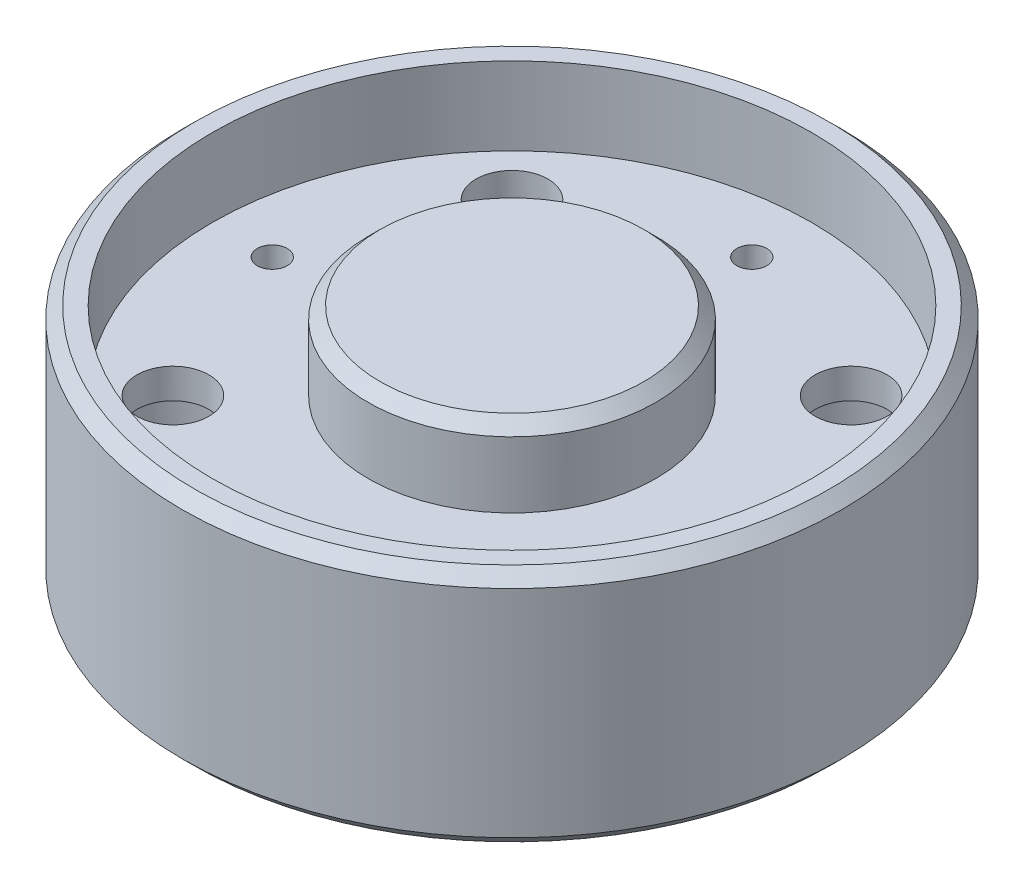
ISO-10303-21;
HEADER;
FILE_DESCRIPTION(('STEP AP214'),'2;1');
FILE_NAME('part.step','',(''),(''),'','','');
FILE_SCHEMA(('AUTOMOTIVE_DESIGN { 1 0 10303 214 1 1 1 1 }'));
ENDSEC;
DATA;
#1=APPLICATION_CONTEXT('core data for automotive mechanical design processes');
#2=APPLICATION_PROTOCOL_DEFINITION('international standard','automotive_design',2000,#1);
#3=PRODUCT_CONTEXT('',#1,'mechanical');
#4=PRODUCT('Part','Part','',(#3));
#5=PRODUCT_RELATED_PRODUCT_CATEGORY('part','',(#4));
#6=PRODUCT_DEFINITION_FORMATION('','',#4);
#7=PRODUCT_DEFINITION_CONTEXT('part definition',#1,'design');
#8=PRODUCT_DEFINITION('design','',#6,#7);
#9=PRODUCT_DEFINITION_SHAPE('','',#8);
#10=(LENGTH_UNIT() NAMED_UNIT(*) SI_UNIT(.MILLI.,.METRE.));
#11=(NAMED_UNIT(*) PLANE_ANGLE_UNIT() SI_UNIT($,.RADIAN.));
#12=(NAMED_UNIT(*) SI_UNIT($,.STERADIAN.) SOLID_ANGLE_UNIT());
#13=UNCERTAINTY_MEASURE_WITH_UNIT(LENGTH_MEASURE(1.E-05),#10,'distance_accuracy_value','');
#14=(GEOMETRIC_REPRESENTATION_CONTEXT(3) GLOBAL_UNCERTAINTY_ASSIGNED_CONTEXT((#13)) GLOBAL_UNIT_ASSIGNED_CONTEXT((#10,
#11,#12)) REPRESENTATION_CONTEXT('',''));
#15=CARTESIAN_POINT('',(0.,0.,0.));
#16=DIRECTION('',(0.,0.,1.));
#17=DIRECTION('',(1.,0.,0.));
#18=AXIS2_PLACEMENT_3D('',#15,#16,#17);
#19=CARTESIAN_POINT('',(14.142135623731,-1.2E-05,-14.142135623731));
#20=DIRECTION('',(0.,1.,0.));
#21=DIRECTION('',(0.,0.,1.));
#22=AXIS2_PLACEMENT_3D('',#19,#20,#21);
#23=CYLINDRICAL_SURFACE('',#22,3.);
#24=CARTESIAN_POINT('',(14.142135623731,13.5,-14.142135623731));
#25=DIRECTION('',(0.,1.,0.));
#26=DIRECTION('',(-1.,0.,0.));
#27=AXIS2_PLACEMENT_3D('',#24,#25,#26);
#28=CIRCLE('',#27,3.);
#29=CARTESIAN_POINT('',(11.142135623731,13.5,-14.142135623731));
#30=VERTEX_POINT('',#29);
#31=EDGE_CURVE('E591',#30,#30,#28,.T.);
#32=ORIENTED_EDGE('',*,*,#31,.T.);
#33=EDGE_LOOP('',(#32));
#34=FACE_BOUND('',#33,.T.);
#35=CARTESIAN_POINT('',(14.142135623731,11.,-14.142135623731));
#36=DIRECTION('',(0.,-1.,0.));
#37=DIRECTION('',(1.,0.,0.));
#38=AXIS2_PLACEMENT_3D('',#35,#36,#37);
#39=CIRCLE('',#38,3.);
#40=CARTESIAN_POINT('',(17.142135623731,11.0000000000001,-14.142135623731));
#41=VERTEX_POINT('',#40);
#42=EDGE_CURVE('E574',#41,#41,#39,.F.);
#43=ORIENTED_EDGE('',*,*,#42,.F.);
#44=EDGE_LOOP('',(#43));
#45=FACE_BOUND('',#44,.T.);
#46=ADVANCED_FACE('F40',(#34,#45),#23,.F.);
#47=CARTESIAN_POINT('',(-14.1421356237309,-1.2E-05,14.1421356237309));
#48=DIRECTION('',(0.,1.,0.));
#49=DIRECTION('',(0.,0.,1.));
#50=AXIS2_PLACEMENT_3D('',#47,#48,#49);
#51=CYLINDRICAL_SURFACE('',#50,3.);
#52=CARTESIAN_POINT('',(-14.1421356237309,13.4999999999999,14.1421356237309));
#53=DIRECTION('',(0.,1.,0.));
#54=DIRECTION('',(-1.,0.,0.));
#55=AXIS2_PLACEMENT_3D('',#52,#53,#54);
#56=CIRCLE('',#55,3.);
#57=CARTESIAN_POINT('',(-17.1421356237309,13.4999999999999,14.1421356237309));
#58=VERTEX_POINT('',#57);
#59=EDGE_CURVE('E166',#58,#58,#56,.T.);
#60=ORIENTED_EDGE('',*,*,#59,.T.);
#61=EDGE_LOOP('',(#60));
#62=FACE_BOUND('',#61,.T.);
#63=CARTESIAN_POINT('',(-14.1421356237309,11.,14.1421356237309));
#64=DIRECTION('',(0.,-1.,0.));
#65=DIRECTION('',(1.,0.,0.));
#66=AXIS2_PLACEMENT_3D('',#63,#64,#65);
#67=CIRCLE('',#66,3.);
#68=CARTESIAN_POINT('',(-11.1421356237309,11.,14.1421356237309));
#69=VERTEX_POINT('',#68);
#70=EDGE_CURVE('E181',#69,#69,#67,.F.);
#71=ORIENTED_EDGE('',*,*,#70,.F.);
#72=EDGE_LOOP('',(#71));
#73=FACE_BOUND('',#72,.T.);
#74=ADVANCED_FACE('F264',(#62,#73),#51,.F.);
#75=CARTESIAN_POINT('',(2.14969366173535E-12,-626.687351977546,0.));
#76=DIRECTION('',(0.,-1.,0.));
#77=DIRECTION('',(1.,0.,0.));
#78=AXIS2_PLACEMENT_3D('',#75,#76,#77);
#79=CYLINDRICAL_SURFACE('',#78,22.4);
#80=DIRECTION('',(0.,-1.,0.));
#81=VECTOR('',#80,1.);
#82=CARTESIAN_POINT('',(-19.0841693823817,5.49999999999993,-11.7283621612128));
#83=LINE('',#82,#81);
#84=CARTESIAN_POINT('',(-19.0841693823816,5.4999999999999,-11.7283621612128));
#85=VERTEX_POINT('',#84);
#86=CARTESIAN_POINT('',(-19.0841693823816,0.,-11.7283621612128));
#87=VERTEX_POINT('',#86);
#88=EDGE_CURVE('E167',#85,#87,#83,.T.);
#89=ORIENTED_EDGE('',*,*,#88,.F.);
#90=CARTESIAN_POINT('',(0.,5.49999999999984,0.));
#91=DIRECTION('',(0.,-1.,0.));
#92=DIRECTION('',(1.,0.,0.));
#93=AXIS2_PLACEMENT_3D('',#90,#91,#92);
#94=CIRCLE('',#93,22.4);
#95=CARTESIAN_POINT('',(-19.0841693823816,5.4999999999999,11.7283621612128));
#96=VERTEX_POINT('',#95);
#97=EDGE_CURVE('E146',#96,#85,#94,.T.);
#98=ORIENTED_EDGE('',*,*,#97,.F.);
#99=DIRECTION('',(0.,-1.,0.));
#100=VECTOR('',#99,1.);
#101=CARTESIAN_POINT('',(-19.0841693823817,5.49999999999993,11.7283621612128));
#102=LINE('',#101,#100);
#103=CARTESIAN_POINT('',(-19.0841693823816,0.,11.7283621612128));
#104=VERTEX_POINT('',#103);
#105=EDGE_CURVE('E117',#104,#96,#102,.F.);
#106=ORIENTED_EDGE('',*,*,#105,.F.);
#107=CARTESIAN_POINT('',(0.,-1.11022302462516E-13,0.));
#108=DIRECTION('',(0.,-1.,0.));
#109=DIRECTION('',(1.,0.,0.));
#110=AXIS2_PLACEMENT_3D('',#107,#108,#109);
#111=CIRCLE('',#110,22.4);
#112=EDGE_CURVE('E128',#104,#87,#111,.T.);
#113=ORIENTED_EDGE('',*,*,#112,.T.);
#114=EDGE_LOOP('',(#89,#98,#106,#113));
#115=FACE_BOUND('',#114,.T.);
#116=ADVANCED_FACE('F261',(#115),#79,.F.);
#117=DIRECTION('',(0.,-1.,0.));
#118=VECTOR('',#117,1.);
#119=CARTESIAN_POINT('',(11.7283621612128,5.50000000000004,19.0841693823816));
#120=LINE('',#119,#118);
#121=CARTESIAN_POINT('',(11.7283621612128,0.,19.0841693823816));
#122=VERTEX_POINT('',#121);
#123=CARTESIAN_POINT('',(11.7283621612128,5.50000000000001,19.0841693823816));
#124=VERTEX_POINT('',#123);
#125=EDGE_CURVE('E56',#122,#124,#120,.F.);
#126=ORIENTED_EDGE('',*,*,#125,.F.);
#127=CARTESIAN_POINT('',(-11.7283621612128,0.,19.0841693823816));
#128=VERTEX_POINT('',#127);
#129=EDGE_CURVE('E126',#122,#128,#111,.T.);
#130=ORIENTED_EDGE('',*,*,#129,.T.);
#131=DIRECTION('',(0.,-1.,0.));
#132=VECTOR('',#131,1.);
#133=CARTESIAN_POINT('',(-11.7283621612128,5.49999999999996,19.0841693823816));
#134=LINE('',#133,#132);
#135=CARTESIAN_POINT('',(-11.7283621612128,5.49999999999993,19.0841693823816));
#136=VERTEX_POINT('',#135);
#137=EDGE_CURVE('E105',#136,#128,#134,.T.);
#138=ORIENTED_EDGE('',*,*,#137,.F.);
#139=EDGE_CURVE('E142',#124,#136,#94,.T.);
#140=ORIENTED_EDGE('',*,*,#139,.F.);
#141=EDGE_LOOP('',(#126,#130,#138,#140));
#142=FACE_BOUND('',#141,.T.);
#143=ADVANCED_FACE('F132',(#142),#79,.F.);
#144=DIRECTION('',(0.,-1.,0.));
#145=VECTOR('',#144,1.);
#146=CARTESIAN_POINT('',(19.0841693823816,5.50000000000007,-11.7283621612128));
#147=LINE('',#146,#145);
#148=CARTESIAN_POINT('',(19.0841693823816,0.,-11.7283621612128));
#149=VERTEX_POINT('',#148);
#150=CARTESIAN_POINT('',(19.0841693823816,5.50000000000004,-11.7283621612128));
#151=VERTEX_POINT('',#150);
#152=EDGE_CURVE('E64',#149,#151,#147,.F.);
#153=ORIENTED_EDGE('',*,*,#152,.F.);
#154=CARTESIAN_POINT('',(19.0841693823816,0.,11.7283621612128));
#155=VERTEX_POINT('',#154);
#156=EDGE_CURVE('E135',#149,#155,#111,.T.);
#157=ORIENTED_EDGE('',*,*,#156,.T.);
#158=DIRECTION('',(0.,-1.,0.));
#159=VECTOR('',#158,1.);
#160=CARTESIAN_POINT('',(19.0841693823816,5.50000000000007,11.7283621612128));
#161=LINE('',#160,#159);
#162=CARTESIAN_POINT('',(19.0841693823816,5.50000000000004,11.7283621612128));
#163=VERTEX_POINT('',#162);
#164=EDGE_CURVE('E176',#163,#155,#161,.T.);
#165=ORIENTED_EDGE('',*,*,#164,.F.);
#166=EDGE_CURVE('E147',#151,#163,#94,.T.);
#167=ORIENTED_EDGE('',*,*,#166,.F.);
#168=EDGE_LOOP('',(#153,#157,#165,#167));
#169=FACE_BOUND('',#168,.T.);
#170=ADVANCED_FACE('F252',(#169),#79,.F.);
#171=CARTESIAN_POINT('',(27.4999999999999,0.,0.));
#172=DIRECTION('',(0.,-1.,0.));
#173=DIRECTION('',(1.,0.,0.));
#174=AXIS2_PLACEMENT_3D('',#171,#172,#173);
#175=PLANE('',#174);
#176=CARTESIAN_POINT('',(0.,0.,0.));
#177=DIRECTION('',(0.,-1.,0.));
#178=DIRECTION('',(1.,0.,0.));
#179=AXIS2_PLACEMENT_3D('',#176,#177,#178);
#180=CIRCLE('',#179,26.4999999999998);
#181=CARTESIAN_POINT('',(26.4999999999998,0.,0.));
#182=VERTEX_POINT('',#181);
#183=EDGE_CURVE('E11',#182,#182,#180,.T.);
#184=ORIENTED_EDGE('',*,*,#183,.T.);
#185=EDGE_LOOP('',(#184));
#186=FACE_BOUND('',#185,.T.);
#187=CARTESIAN_POINT('',(-14.1421356237309,0.,-14.1421356237309));
#188=DIRECTION('',(0.,-1.,0.));
#189=DIRECTION('',(-1.,0.,0.));
#190=AXIS2_PLACEMENT_3D('',#187,#188,#189);
#191=CIRCLE('',#190,5.5);
#192=CARTESIAN_POINT('',(-11.7283621612128,0.,-19.0841693823816));
#193=VERTEX_POINT('',#192);
#194=EDGE_CURVE('E182',#87,#193,#191,.T.);
#195=ORIENTED_EDGE('',*,*,#194,.F.);
#196=ORIENTED_EDGE('',*,*,#112,.F.);
#197=CARTESIAN_POINT('',(-14.1421356237309,0.,14.1421356237309));
#198=DIRECTION('',(0.,-1.,0.));
#199=DIRECTION('',(1.,0.,0.));
#200=AXIS2_PLACEMENT_3D('',#197,#198,#199);
#201=CIRCLE('',#200,5.5);
#202=EDGE_CURVE('E109',#128,#104,#201,.T.);
#203=ORIENTED_EDGE('',*,*,#202,.F.);
#204=ORIENTED_EDGE('',*,*,#129,.F.);
#205=CARTESIAN_POINT('',(14.1421356237309,0.,14.1421356237309));
#206=DIRECTION('',(0.,-1.,0.));
#207=DIRECTION('',(-1.,0.,0.));
#208=AXIS2_PLACEMENT_3D('',#205,#206,#207);
#209=CIRCLE('',#208,5.5);
#210=EDGE_CURVE('E193',#155,#122,#209,.T.);
#211=ORIENTED_EDGE('',*,*,#210,.F.);
#212=ORIENTED_EDGE('',*,*,#156,.F.);
#213=CARTESIAN_POINT('',(14.1421356237309,0.,-14.1421356237309));
#214=DIRECTION('',(0.,-1.,0.));
#215=DIRECTION('',(1.,0.,0.));
#216=AXIS2_PLACEMENT_3D('',#213,#214,#215);
#217=CIRCLE('',#216,5.5);
#218=CARTESIAN_POINT('',(11.7283621612128,0.,-19.0841693823816));
#219=VERTEX_POINT('',#218);
#220=EDGE_CURVE('E188',#219,#149,#217,.T.);
#221=ORIENTED_EDGE('',*,*,#220,.F.);
#222=EDGE_CURVE('E134',#193,#219,#111,.T.);
#223=ORIENTED_EDGE('',*,*,#222,.F.);
#224=EDGE_LOOP('',(#195,#196,#203,#204,#211,#212,#221,#223));
#225=FACE_BOUND('',#224,.T.);
#226=ADVANCED_FACE('F124',(#186,#225),#175,.T.);
#227=DIRECTION('',(0.,-1.,0.));
#228=VECTOR('',#227,1.);
#229=CARTESIAN_POINT('',(-11.7283621612128,5.49999999999996,-19.0841693823816));
#230=LINE('',#229,#228);
#231=CARTESIAN_POINT('',(-11.7283621612128,5.49999999999993,-19.0841693823816));
#232=VERTEX_POINT('',#231);
#233=EDGE_CURVE('E170',#193,#232,#230,.F.);
#234=ORIENTED_EDGE('',*,*,#233,.F.);
#235=ORIENTED_EDGE('',*,*,#222,.T.);
#236=DIRECTION('',(0.,-1.,0.));
#237=VECTOR('',#236,1.);
#238=CARTESIAN_POINT('',(11.7283621612128,5.50000000000004,-19.0841693823816));
#239=LINE('',#238,#237);
#240=CARTESIAN_POINT('',(11.7283621612128,5.50000000000001,-19.0841693823816));
#241=VERTEX_POINT('',#240);
#242=EDGE_CURVE('E173',#241,#219,#239,.T.);
#243=ORIENTED_EDGE('',*,*,#242,.F.);
#244=EDGE_CURVE('E150',#232,#241,#94,.T.);
#245=ORIENTED_EDGE('',*,*,#244,.F.);
#246=EDGE_LOOP('',(#234,#235,#243,#245));
#247=FACE_BOUND('',#246,.T.);
#248=ADVANCED_FACE('F227',(#247),#79,.F.);
#249=CARTESIAN_POINT('',(22.4,5.50000000000004,0.));
#250=DIRECTION('',(0.,-1.,0.));
#251=DIRECTION('',(1.,0.,0.));
#252=AXIS2_PLACEMENT_3D('',#249,#250,#251);
#253=PLANE('',#252);
#254=CARTESIAN_POINT('',(-20.,5.49999999999989,0.));
#255=DIRECTION('',(0.,-1.,0.));
#256=DIRECTION('',(1.,0.,0.));
#257=AXIS2_PLACEMENT_3D('',#254,#255,#256);
#258=CIRCLE('',#257,1.25);
#259=CARTESIAN_POINT('',(-18.75,5.49999999999989,0.));
#260=VERTEX_POINT('',#259);
#261=EDGE_CURVE('E185',#260,#260,#258,.T.);
#262=ORIENTED_EDGE('',*,*,#261,.F.);
#263=EDGE_LOOP('',(#262));
#264=FACE_BOUND('',#263,.T.);
#265=CARTESIAN_POINT('',(0.,5.49999999999996,-20.));
#266=DIRECTION('',(0.,-1.,0.));
#267=DIRECTION('',(-1.,0.,0.));
#268=AXIS2_PLACEMENT_3D('',#265,#266,#267);
#269=CIRCLE('',#268,1.25);
#270=CARTESIAN_POINT('',(-1.25000000000002,5.49999999999995,-20.));
#271=VERTEX_POINT('',#270);
#272=EDGE_CURVE('E212',#271,#271,#269,.T.);
#273=ORIENTED_EDGE('',*,*,#272,.F.);
#274=EDGE_LOOP('',(#273));
#275=FACE_BOUND('',#274,.T.);
#276=CARTESIAN_POINT('',(20.,5.50000000000003,0.));
#277=DIRECTION('',(0.,-1.,0.));
#278=DIRECTION('',(-1.,0.,0.));
#279=AXIS2_PLACEMENT_3D('',#276,#277,#278);
#280=CIRCLE('',#279,1.25);
#281=CARTESIAN_POINT('',(18.75,5.50000000000002,0.));
#282=VERTEX_POINT('',#281);
#283=EDGE_CURVE('E206',#282,#282,#280,.T.);
#284=ORIENTED_EDGE('',*,*,#283,.F.);
#285=EDGE_LOOP('',(#284));
#286=FACE_BOUND('',#285,.T.);
#287=CARTESIAN_POINT('',(0.,5.49999999999996,20.));
#288=DIRECTION('',(0.,-1.,0.));
#289=DIRECTION('',(1.,0.,0.));
#290=AXIS2_PLACEMENT_3D('',#287,#288,#289);
#291=CIRCLE('',#290,1.25);
#292=CARTESIAN_POINT('',(1.24999999999998,5.49999999999996,20.));
#293=VERTEX_POINT('',#292);
#294=EDGE_CURVE('E200',#293,#293,#291,.T.);
#295=ORIENTED_EDGE('',*,*,#294,.F.);
#296=EDGE_LOOP('',(#295));
#297=FACE_BOUND('',#296,.T.);
#298=CARTESIAN_POINT('',(-14.142135623731,5.49999999999991,-14.1421356237309));
#299=DIRECTION('',(0.,-1.,0.));
#300=DIRECTION('',(1.,0.,0.));
#301=AXIS2_PLACEMENT_3D('',#298,#299,#300);
#302=CIRCLE('',#301,5.5);
#303=EDGE_CURVE('E235',#232,#85,#302,.T.);
#304=ORIENTED_EDGE('',*,*,#303,.F.);
#305=ORIENTED_EDGE('',*,*,#244,.T.);
#306=CARTESIAN_POINT('',(14.1421356237309,5.50000000000001,-14.1421356237309));
#307=DIRECTION('',(0.,-1.,0.));
#308=DIRECTION('',(1.,0.,0.));
#309=AXIS2_PLACEMENT_3D('',#306,#307,#308);
#310=CIRCLE('',#309,5.5);
#311=EDGE_CURVE('E241',#151,#241,#310,.T.);
#312=ORIENTED_EDGE('',*,*,#311,.F.);
#313=ORIENTED_EDGE('',*,*,#166,.T.);
#314=CARTESIAN_POINT('',(14.1421356237309,5.50000000000001,14.1421356237309));
#315=DIRECTION('',(0.,-1.,0.));
#316=DIRECTION('',(1.,0.,0.));
#317=AXIS2_PLACEMENT_3D('',#314,#315,#316);
#318=CIRCLE('',#317,5.5);
#319=EDGE_CURVE('E136',#124,#163,#318,.T.);
#320=ORIENTED_EDGE('',*,*,#319,.F.);
#321=ORIENTED_EDGE('',*,*,#139,.T.);
#322=CARTESIAN_POINT('',(-14.142135623731,5.49999999999991,14.1421356237309));
#323=DIRECTION('',(0.,-1.,0.));
#324=DIRECTION('',(1.,0.,0.));
#325=AXIS2_PLACEMENT_3D('',#322,#323,#324);
#326=CIRCLE('',#325,5.5);
#327=EDGE_CURVE('E112',#96,#136,#326,.T.);
#328=ORIENTED_EDGE('',*,*,#327,.F.);
#329=ORIENTED_EDGE('',*,*,#97,.T.);
#330=EDGE_LOOP('',(#304,#305,#312,#313,#320,#321,#328,#329));
#331=FACE_BOUND('',#330,.T.);
#332=ADVANCED_FACE('F223',(#264,#275,#286,#297,#331),#253,.T.);
#333=CARTESIAN_POINT('',(12.,20.,0.));
#334=DIRECTION('',(0.,1.,0.));
#335=DIRECTION('',(-1.,0.,0.));
#336=AXIS2_PLACEMENT_3D('',#333,#334,#335);
#337=PLANE('',#336);
#338=CARTESIAN_POINT('',(0.,20.,0.));
#339=DIRECTION('',(0.,1.,0.));
#340=DIRECTION('',(-1.,0.,0.));
#341=AXIS2_PLACEMENT_3D('',#338,#339,#340);
#342=CIRCLE('',#341,11.0000000000001);
#343=CARTESIAN_POINT('',(-11.0000000000002,19.9999999999999,0.));
#344=VERTEX_POINT('',#343);
#345=EDGE_CURVE('E312',#344,#344,#342,.T.);
#346=ORIENTED_EDGE('',*,*,#345,.T.);
#347=EDGE_LOOP('',(#346));
#348=FACE_BOUND('',#347,.T.);
#349=ADVANCED_FACE('F226',(#348),#337,.T.);
#350=CARTESIAN_POINT('',(2.14969366173535E-12,-626.687351977546,0.));
#351=DIRECTION('',(0.,-1.,0.));
#352=DIRECTION('',(1.,0.,0.));
#353=AXIS2_PLACEMENT_3D('',#350,#351,#352);
#354=CYLINDRICAL_SURFACE('',#353,12.0000000000001);
#355=CARTESIAN_POINT('',(0.,19.,0.));
#356=DIRECTION('',(0.,1.,0.));
#357=DIRECTION('',(-1.,0.,0.));
#358=AXIS2_PLACEMENT_3D('',#355,#356,#357);
#359=CIRCLE('',#358,12.0000000000001);
#360=CARTESIAN_POINT('',(-12.0000000000001,19.,0.));
#361=VERTEX_POINT('',#360);
#362=EDGE_CURVE('E240',#361,#361,#359,.F.);
#363=ORIENTED_EDGE('',*,*,#362,.T.);
#364=EDGE_LOOP('',(#363));
#365=FACE_BOUND('',#364,.T.);
#366=CARTESIAN_POINT('',(0.,13.5,0.));
#367=DIRECTION('',(0.,-1.,0.));
#368=DIRECTION('',(1.,0.,0.));
#369=AXIS2_PLACEMENT_3D('',#366,#367,#368);
#370=CIRCLE('',#369,12.);
#371=CARTESIAN_POINT('',(12.,13.5,0.));
#372=VERTEX_POINT('',#371);
#373=EDGE_CURVE('E153',#372,#372,#370,.T.);
#374=ORIENTED_EDGE('',*,*,#373,.F.);
#375=EDGE_LOOP('',(#374));
#376=FACE_BOUND('',#375,.T.);
#377=ADVANCED_FACE('F301',(#365,#376),#354,.T.);
#378=CARTESIAN_POINT('',(25.,13.5,0.));
#379=DIRECTION('',(0.,1.,0.));
#380=DIRECTION('',(-1.,0.,0.));
#381=AXIS2_PLACEMENT_3D('',#378,#379,#380);
#382=PLANE('',#381);
#383=CARTESIAN_POINT('',(-20.,13.4999999999999,0.));
#384=DIRECTION('',(0.,1.,0.));
#385=DIRECTION('',(-1.,0.,0.));
#386=AXIS2_PLACEMENT_3D('',#383,#384,#385);
#387=CIRCLE('',#386,1.25);
#388=CARTESIAN_POINT('',(-21.25,13.4999999999999,0.));
#389=VERTEX_POINT('',#388);
#390=EDGE_CURVE('E215',#389,#389,#387,.F.);
#391=ORIENTED_EDGE('',*,*,#390,.T.);
#392=EDGE_LOOP('',(#391));
#393=FACE_BOUND('',#392,.T.);
#394=CARTESIAN_POINT('',(0.,13.4999999999999,-20.));
#395=DIRECTION('',(0.,1.,0.));
#396=DIRECTION('',(-1.,0.,0.));
#397=AXIS2_PLACEMENT_3D('',#394,#395,#396);
#398=CIRCLE('',#397,1.25);
#399=CARTESIAN_POINT('',(-1.25000000000005,13.4999999999999,-20.));
#400=VERTEX_POINT('',#399);
#401=EDGE_CURVE('E209',#400,#400,#398,.F.);
#402=ORIENTED_EDGE('',*,*,#401,.T.);
#403=EDGE_LOOP('',(#402));
#404=FACE_BOUND('',#403,.T.);
#405=CARTESIAN_POINT('',(20.,13.5,0.));
#406=DIRECTION('',(0.,1.,0.));
#407=DIRECTION('',(-1.,0.,0.));
#408=AXIS2_PLACEMENT_3D('',#405,#406,#407);
#409=CIRCLE('',#408,1.25);
#410=CARTESIAN_POINT('',(18.75,13.5,0.));
#411=VERTEX_POINT('',#410);
#412=EDGE_CURVE('E203',#411,#411,#409,.F.);
#413=ORIENTED_EDGE('',*,*,#412,.T.);
#414=EDGE_LOOP('',(#413));
#415=FACE_BOUND('',#414,.T.);
#416=CARTESIAN_POINT('',(0.,13.4999999999999,20.));
#417=DIRECTION('',(0.,1.,0.));
#418=DIRECTION('',(-1.,0.,0.));
#419=AXIS2_PLACEMENT_3D('',#416,#417,#418);
#420=CIRCLE('',#419,1.25);
#421=CARTESIAN_POINT('',(-1.25000000000005,13.4999999999999,20.));
#422=VERTEX_POINT('',#421);
#423=EDGE_CURVE('E197',#422,#422,#420,.F.);
#424=ORIENTED_EDGE('',*,*,#423,.T.);
#425=EDGE_LOOP('',(#424));
#426=FACE_BOUND('',#425,.T.);
#427=ORIENTED_EDGE('',*,*,#59,.F.);
#428=EDGE_LOOP('',(#427));
#429=FACE_BOUND('',#428,.T.);
#430=CARTESIAN_POINT('',(14.142135623731,13.5,14.1421356237309));
#431=DIRECTION('',(0.,1.,0.));
#432=DIRECTION('',(-1.,0.,0.));
#433=AXIS2_PLACEMENT_3D('',#430,#431,#432);
#434=CIRCLE('',#433,3.);
#435=CARTESIAN_POINT('',(11.142135623731,13.5,14.1421356237309));
#436=VERTEX_POINT('',#435);
#437=EDGE_CURVE('E588',#436,#436,#434,.T.);
#438=ORIENTED_EDGE('',*,*,#437,.F.);
#439=EDGE_LOOP('',(#438));
#440=FACE_BOUND('',#439,.T.);
#441=ORIENTED_EDGE('',*,*,#31,.F.);
#442=EDGE_LOOP('',(#441));
#443=FACE_BOUND('',#442,.T.);
#444=CARTESIAN_POINT('',(-14.1421356237309,13.4999999999999,-14.142135623731));
#445=DIRECTION('',(0.,1.,0.));
#446=DIRECTION('',(-1.,0.,0.));
#447=AXIS2_PLACEMENT_3D('',#444,#445,#446);
#448=CIRCLE('',#447,3.);
#449=CARTESIAN_POINT('',(-17.1421356237309,13.4999999999999,-14.142135623731));
#450=VERTEX_POINT('',#449);
#451=EDGE_CURVE('E169',#450,#450,#448,.T.);
#452=ORIENTED_EDGE('',*,*,#451,.F.);
#453=EDGE_LOOP('',(#452));
#454=FACE_BOUND('',#453,.T.);
#455=ORIENTED_EDGE('',*,*,#373,.T.);
#456=EDGE_LOOP('',(#455));
#457=FACE_BOUND('',#456,.T.);
#458=CARTESIAN_POINT('',(0.,13.4999999999998,0.));
#459=DIRECTION('',(0.,-1.,0.));
#460=DIRECTION('',(1.,0.,0.));
#461=AXIS2_PLACEMENT_3D('',#458,#459,#460);
#462=CIRCLE('',#461,25.);
#463=CARTESIAN_POINT('',(25.,13.4999999999999,0.));
#464=VERTEX_POINT('',#463);
#465=EDGE_CURVE('E157',#464,#464,#462,.T.);
#466=ORIENTED_EDGE('',*,*,#465,.F.);
#467=EDGE_LOOP('',(#466));
#468=FACE_BOUND('',#467,.T.);
#469=ADVANCED_FACE('F297',(#393,#404,#415,#426,#429,#440,#443,#454,#457,#468),#382,.T.);
#470=CARTESIAN_POINT('',(2.14969366173535E-12,-626.687351977546,0.));
#471=DIRECTION('',(0.,-1.,0.));
#472=DIRECTION('',(1.,0.,0.));
#473=AXIS2_PLACEMENT_3D('',#470,#471,#472);
#474=CYLINDRICAL_SURFACE('',#473,25.0000000000001);
#475=ORIENTED_EDGE('',*,*,#465,.T.);
#476=EDGE_LOOP('',(#475));
#477=FACE_BOUND('',#476,.T.);
#478=CARTESIAN_POINT('',(0.,19.9999999999999,0.));
#479=DIRECTION('',(0.,-1.,0.));
#480=DIRECTION('',(1.,0.,0.));
#481=AXIS2_PLACEMENT_3D('',#478,#479,#480);
#482=CIRCLE('',#481,25.0000000000001);
#483=CARTESIAN_POINT('',(25.,20.,0.));
#484=VERTEX_POINT('',#483);
#485=EDGE_CURVE('E161',#484,#484,#482,.T.);
#486=ORIENTED_EDGE('',*,*,#485,.F.);
#487=EDGE_LOOP('',(#486));
#488=FACE_BOUND('',#487,.T.);
#489=ADVANCED_FACE('F293',(#477,#488),#474,.F.);
#490=CARTESIAN_POINT('',(27.5,20.,0.));
#491=DIRECTION('',(0.,1.,0.));
#492=DIRECTION('',(-1.,0.,0.));
#493=AXIS2_PLACEMENT_3D('',#490,#491,#492);
#494=PLANE('',#493);
#495=CARTESIAN_POINT('',(0.,19.9999999999999,0.));
#496=DIRECTION('',(0.,1.,0.));
#497=DIRECTION('',(-1.,0.,0.));
#498=AXIS2_PLACEMENT_3D('',#495,#496,#497);
#499=CIRCLE('',#498,26.5);
#500=CARTESIAN_POINT('',(-26.5000000000001,19.9999999999998,0.));
#501=VERTEX_POINT('',#500);
#502=EDGE_CURVE('E49',#501,#501,#499,.T.);
#503=ORIENTED_EDGE('',*,*,#502,.T.);
#504=EDGE_LOOP('',(#503));
#505=FACE_BOUND('',#504,.T.);
#506=ORIENTED_EDGE('',*,*,#485,.T.);
#507=EDGE_LOOP('',(#506));
#508=FACE_BOUND('',#507,.T.);
#509=ADVANCED_FACE('F289',(#505,#508),#494,.T.);
#510=CARTESIAN_POINT('',(2.14969366173535E-12,-626.687351977546,0.));
#511=DIRECTION('',(0.,-1.,0.));
#512=DIRECTION('',(1.,0.,0.));
#513=AXIS2_PLACEMENT_3D('',#510,#511,#512);
#514=CYLINDRICAL_SURFACE('',#513,27.5);
#515=CARTESIAN_POINT('',(0.,18.9999999999999,0.));
#516=DIRECTION('',(0.,1.,0.));
#517=DIRECTION('',(-1.,0.,0.));
#518=AXIS2_PLACEMENT_3D('',#515,#516,#517);
#519=CIRCLE('',#518,27.5);
#520=CARTESIAN_POINT('',(-27.5000000000001,18.9999999999998,0.));
#521=VERTEX_POINT('',#520);
#522=EDGE_CURVE('E317',#521,#521,#519,.F.);
#523=ORIENTED_EDGE('',*,*,#522,.T.);
#524=EDGE_LOOP('',(#523));
#525=FACE_BOUND('',#524,.T.);
#526=CARTESIAN_POINT('',(0.,1.00000000000011,0.));
#527=DIRECTION('',(0.,-1.,0.));
#528=DIRECTION('',(1.,0.,0.));
#529=AXIS2_PLACEMENT_3D('',#526,#527,#528);
#530=CIRCLE('',#529,27.5);
#531=CARTESIAN_POINT('',(27.5,1.00000000000021,0.));
#532=VERTEX_POINT('',#531);
#533=EDGE_CURVE('E314',#532,#532,#530,.F.);
#534=ORIENTED_EDGE('',*,*,#533,.T.);
#535=EDGE_LOOP('',(#534));
#536=FACE_BOUND('',#535,.T.);
#537=ADVANCED_FACE('F285',(#525,#536),#514,.T.);
#538=CARTESIAN_POINT('',(-14.1421356237309,-1.2E-05,-14.142135623731));
#539=DIRECTION('',(0.,1.,0.));
#540=DIRECTION('',(0.,0.,1.));
#541=AXIS2_PLACEMENT_3D('',#538,#539,#540);
#542=CYLINDRICAL_SURFACE('',#541,3.);
#543=CARTESIAN_POINT('',(-14.1421356237309,11.,-14.142135623731));
#544=DIRECTION('',(0.,1.,0.));
#545=DIRECTION('',(-1.,0.,0.));
#546=AXIS2_PLACEMENT_3D('',#543,#544,#545);
#547=CIRCLE('',#546,3.);
#548=CARTESIAN_POINT('',(-17.1421356237309,10.9999999999999,-14.142135623731));
#549=VERTEX_POINT('',#548);
#550=EDGE_CURVE('E118',#549,#549,#547,.F.);
#551=ORIENTED_EDGE('',*,*,#550,.T.);
#552=EDGE_LOOP('',(#551));
#553=FACE_BOUND('',#552,.T.);
#554=ORIENTED_EDGE('',*,*,#451,.T.);
#555=EDGE_LOOP('',(#554));
#556=FACE_BOUND('',#555,.T.);
#557=ADVANCED_FACE('F280',(#553,#556),#542,.F.);
#558=CARTESIAN_POINT('',(14.142135623731,-1.2E-05,14.1421356237309));
#559=DIRECTION('',(0.,1.,0.));
#560=DIRECTION('',(0.,0.,1.));
#561=AXIS2_PLACEMENT_3D('',#558,#559,#560);
#562=CYLINDRICAL_SURFACE('',#561,3.);
#563=CARTESIAN_POINT('',(14.142135623731,11.,14.1421356237309));
#564=DIRECTION('',(0.,1.,0.));
#565=DIRECTION('',(-1.,0.,0.));
#566=AXIS2_PLACEMENT_3D('',#563,#564,#565);
#567=CIRCLE('',#566,3.);
#568=CARTESIAN_POINT('',(11.142135623731,11.,14.1421356237309));
#569=VERTEX_POINT('',#568);
#570=EDGE_CURVE('E577',#569,#569,#567,.F.);
#571=ORIENTED_EDGE('',*,*,#570,.T.);
#572=EDGE_LOOP('',(#571));
#573=FACE_BOUND('',#572,.T.);
#574=ORIENTED_EDGE('',*,*,#437,.T.);
#575=EDGE_LOOP('',(#574));
#576=FACE_BOUND('',#575,.T.);
#577=ADVANCED_FACE('F277',(#573,#576),#562,.F.);
#578=CARTESIAN_POINT('',(-14.142135623731,11.,14.1421356237309));
#579=DIRECTION('',(0.,-1.,0.));
#580=DIRECTION('',(1.,0.,0.));
#581=AXIS2_PLACEMENT_3D('',#578,#579,#580);
#582=PLANE('',#581);
#583=CARTESIAN_POINT('',(-14.142135623731,11.,14.1421356237309));
#584=DIRECTION('',(0.,-1.,0.));
#585=DIRECTION('',(1.,0.,0.));
#586=AXIS2_PLACEMENT_3D('',#583,#584,#585);
#587=CIRCLE('',#586,5.5);
#588=CARTESIAN_POINT('',(-8.64213562373099,11.,14.1421356237309));
#589=VERTEX_POINT('',#588);
#590=EDGE_CURVE('E129',#589,#589,#587,.T.);
#591=ORIENTED_EDGE('',*,*,#590,.T.);
#592=EDGE_LOOP('',(#591));
#593=FACE_BOUND('',#592,.T.);
#594=ORIENTED_EDGE('',*,*,#70,.T.);
#595=EDGE_LOOP('',(#594));
#596=FACE_BOUND('',#595,.T.);
#597=ADVANCED_FACE('F279',(#593,#596),#582,.T.);
#598=CARTESIAN_POINT('',(-14.142135623731,11.,14.1421356237309));
#599=DIRECTION('',(0.,-1.,0.));
#600=DIRECTION('',(1.,0.,0.));
#601=AXIS2_PLACEMENT_3D('',#598,#599,#600);
#602=CYLINDRICAL_SURFACE('',#601,5.5);
#603=ORIENTED_EDGE('',*,*,#105,.T.);
#604=ORIENTED_EDGE('',*,*,#327,.T.);
#605=ORIENTED_EDGE('',*,*,#137,.T.);
#606=ORIENTED_EDGE('',*,*,#202,.T.);
#607=EDGE_LOOP('',(#603,#604,#605,#606));
#608=FACE_BOUND('',#607,.T.);
#609=ORIENTED_EDGE('',*,*,#590,.F.);
#610=EDGE_LOOP('',(#609));
#611=FACE_BOUND('',#610,.T.);
#612=ADVANCED_FACE('F107',(#608,#611),#602,.F.);
#613=CARTESIAN_POINT('',(14.1421356237309,11.,14.1421356237309));
#614=DIRECTION('',(0.,1.,0.));
#615=DIRECTION('',(-1.,0.,0.));
#616=AXIS2_PLACEMENT_3D('',#613,#614,#615);
#617=PLANE('',#616);
#618=CARTESIAN_POINT('',(14.1421356237309,11.,14.1421356237309));
#619=DIRECTION('',(0.,-1.,0.));
#620=DIRECTION('',(-1.,0.,0.));
#621=AXIS2_PLACEMENT_3D('',#618,#619,#620);
#622=CIRCLE('',#621,5.5);
#623=CARTESIAN_POINT('',(8.64213562373091,11.,14.1421356237309));
#624=VERTEX_POINT('',#623);
#625=EDGE_CURVE('E130',#624,#624,#622,.T.);
#626=ORIENTED_EDGE('',*,*,#625,.T.);
#627=EDGE_LOOP('',(#626));
#628=FACE_BOUND('',#627,.T.);
#629=ORIENTED_EDGE('',*,*,#570,.F.);
#630=EDGE_LOOP('',(#629));
#631=FACE_BOUND('',#630,.T.);
#632=ADVANCED_FACE('F419',(#628,#631),#617,.F.);
#633=CARTESIAN_POINT('',(14.1421356237309,11.,14.1421356237309));
#634=DIRECTION('',(0.,-1.,0.));
#635=DIRECTION('',(1.,0.,0.));
#636=AXIS2_PLACEMENT_3D('',#633,#634,#635);
#637=CYLINDRICAL_SURFACE('',#636,5.5);
#638=ORIENTED_EDGE('',*,*,#125,.T.);
#639=ORIENTED_EDGE('',*,*,#319,.T.);
#640=ORIENTED_EDGE('',*,*,#164,.T.);
#641=ORIENTED_EDGE('',*,*,#210,.T.);
#642=EDGE_LOOP('',(#638,#639,#640,#641));
#643=FACE_BOUND('',#642,.T.);
#644=ORIENTED_EDGE('',*,*,#625,.F.);
#645=EDGE_LOOP('',(#644));
#646=FACE_BOUND('',#645,.T.);
#647=ADVANCED_FACE('F250',(#643,#646),#637,.F.);
#648=CARTESIAN_POINT('',(14.1421356237309,11.,-14.1421356237309));
#649=DIRECTION('',(0.,-1.,0.));
#650=DIRECTION('',(1.,0.,0.));
#651=AXIS2_PLACEMENT_3D('',#648,#649,#650);
#652=PLANE('',#651);
#653=CARTESIAN_POINT('',(14.1421356237309,11.,-14.1421356237309));
#654=DIRECTION('',(0.,-1.,0.));
#655=DIRECTION('',(1.,0.,0.));
#656=AXIS2_PLACEMENT_3D('',#653,#654,#655);
#657=CIRCLE('',#656,5.5);
#658=CARTESIAN_POINT('',(19.6421356237309,11.0000000000001,-14.1421356237309));
#659=VERTEX_POINT('',#658);
#660=EDGE_CURVE('E190',#659,#659,#657,.T.);
#661=ORIENTED_EDGE('',*,*,#660,.T.);
#662=EDGE_LOOP('',(#661));
#663=FACE_BOUND('',#662,.T.);
#664=ORIENTED_EDGE('',*,*,#42,.T.);
#665=EDGE_LOOP('',(#664));
#666=FACE_BOUND('',#665,.T.);
#667=ADVANCED_FACE('F405',(#663,#666),#652,.T.);
#668=CARTESIAN_POINT('',(14.1421356237309,11.,-14.1421356237309));
#669=DIRECTION('',(0.,-1.,0.));
#670=DIRECTION('',(1.,0.,0.));
#671=AXIS2_PLACEMENT_3D('',#668,#669,#670);
#672=CYLINDRICAL_SURFACE('',#671,5.5);
#673=ORIENTED_EDGE('',*,*,#152,.T.);
#674=ORIENTED_EDGE('',*,*,#311,.T.);
#675=ORIENTED_EDGE('',*,*,#242,.T.);
#676=ORIENTED_EDGE('',*,*,#220,.T.);
#677=EDGE_LOOP('',(#673,#674,#675,#676));
#678=FACE_BOUND('',#677,.T.);
#679=ORIENTED_EDGE('',*,*,#660,.F.);
#680=EDGE_LOOP('',(#679));
#681=FACE_BOUND('',#680,.T.);
#682=ADVANCED_FACE('F248',(#678,#681),#672,.F.);
#683=CARTESIAN_POINT('',(-14.142135623731,11.,-14.1421356237309));
#684=DIRECTION('',(0.,1.,0.));
#685=DIRECTION('',(-1.,0.,0.));
#686=AXIS2_PLACEMENT_3D('',#683,#684,#685);
#687=PLANE('',#686);
#688=CARTESIAN_POINT('',(-14.142135623731,11.,-14.1421356237309));
#689=DIRECTION('',(0.,-1.,0.));
#690=DIRECTION('',(-1.,0.,0.));
#691=AXIS2_PLACEMENT_3D('',#688,#689,#690);
#692=CIRCLE('',#691,5.5);
#693=CARTESIAN_POINT('',(-19.642135623731,10.9999999999999,-14.1421356237309));
#694=VERTEX_POINT('',#693);
#695=EDGE_CURVE('E184',#694,#694,#692,.T.);
#696=ORIENTED_EDGE('',*,*,#695,.T.);
#697=EDGE_LOOP('',(#696));
#698=FACE_BOUND('',#697,.T.);
#699=ORIENTED_EDGE('',*,*,#550,.F.);
#700=EDGE_LOOP('',(#699));
#701=FACE_BOUND('',#700,.T.);
#702=ADVANCED_FACE('F390',(#698,#701),#687,.F.);
#703=CARTESIAN_POINT('',(-14.142135623731,11.,-14.1421356237309));
#704=DIRECTION('',(0.,-1.,0.));
#705=DIRECTION('',(1.,0.,0.));
#706=AXIS2_PLACEMENT_3D('',#703,#704,#705);
#707=CYLINDRICAL_SURFACE('',#706,5.5);
#708=ORIENTED_EDGE('',*,*,#88,.T.);
#709=ORIENTED_EDGE('',*,*,#194,.T.);
#710=ORIENTED_EDGE('',*,*,#233,.T.);
#711=ORIENTED_EDGE('',*,*,#303,.T.);
#712=EDGE_LOOP('',(#708,#709,#710,#711));
#713=FACE_BOUND('',#712,.T.);
#714=ORIENTED_EDGE('',*,*,#695,.F.);
#715=EDGE_LOOP('',(#714));
#716=FACE_BOUND('',#715,.T.);
#717=ADVANCED_FACE('F382',(#713,#716),#707,.F.);
#718=CARTESIAN_POINT('',(0.,20.0010000000002,20.));
#719=DIRECTION('',(0.,-1.,0.));
#720=DIRECTION('',(1.,0.,0.));
#721=AXIS2_PLACEMENT_3D('',#718,#719,#720);
#722=CYLINDRICAL_SURFACE('',#721,1.25);
#723=ORIENTED_EDGE('',*,*,#423,.F.);
#724=EDGE_LOOP('',(#723));
#725=FACE_BOUND('',#724,.T.);
#726=ORIENTED_EDGE('',*,*,#294,.T.);
#727=EDGE_LOOP('',(#726));
#728=FACE_BOUND('',#727,.T.);
#729=ADVANCED_FACE('F374',(#725,#728),#722,.F.);
#730=CARTESIAN_POINT('',(19.9999999999999,20.0010000000002,0.));
#731=DIRECTION('',(0.,-1.,0.));
#732=DIRECTION('',(1.,0.,0.));
#733=AXIS2_PLACEMENT_3D('',#730,#731,#732);
#734=CYLINDRICAL_SURFACE('',#733,1.25);
#735=ORIENTED_EDGE('',*,*,#412,.F.);
#736=EDGE_LOOP('',(#735));
#737=FACE_BOUND('',#736,.T.);
#738=ORIENTED_EDGE('',*,*,#283,.T.);
#739=EDGE_LOOP('',(#738));
#740=FACE_BOUND('',#739,.T.);
#741=ADVANCED_FACE('F366',(#737,#740),#734,.F.);
#742=CARTESIAN_POINT('',(0.,20.0010000000002,-20.));
#743=DIRECTION('',(0.,-1.,0.));
#744=DIRECTION('',(1.,0.,0.));
#745=AXIS2_PLACEMENT_3D('',#742,#743,#744);
#746=CYLINDRICAL_SURFACE('',#745,1.25);
#747=ORIENTED_EDGE('',*,*,#401,.F.);
#748=EDGE_LOOP('',(#747));
#749=FACE_BOUND('',#748,.T.);
#750=ORIENTED_EDGE('',*,*,#272,.T.);
#751=EDGE_LOOP('',(#750));
#752=FACE_BOUND('',#751,.T.);
#753=ADVANCED_FACE('F357',(#749,#752),#746,.F.);
#754=CARTESIAN_POINT('',(-20.0000000000001,20.0010000000001,0.));
#755=DIRECTION('',(0.,-1.,0.));
#756=DIRECTION('',(1.,0.,0.));
#757=AXIS2_PLACEMENT_3D('',#754,#755,#756);
#758=CYLINDRICAL_SURFACE('',#757,1.25);
#759=ORIENTED_EDGE('',*,*,#390,.F.);
#760=EDGE_LOOP('',(#759));
#761=FACE_BOUND('',#760,.T.);
#762=ORIENTED_EDGE('',*,*,#261,.T.);
#763=EDGE_LOOP('',(#762));
#764=FACE_BOUND('',#763,.T.);
#765=ADVANCED_FACE('F221',(#761,#764),#758,.F.);
#766=CARTESIAN_POINT('',(0.,19.,0.));
#767=DIRECTION('',(0.,-1.,0.));
#768=DIRECTION('',(1.,0.,0.));
#769=AXIS2_PLACEMENT_3D('',#766,#767,#768);
#770=CONICAL_SURFACE('',#769,12.0000000000001,0.78539816339744);
#771=ORIENTED_EDGE('',*,*,#345,.F.);
#772=EDGE_LOOP('',(#771));
#773=FACE_BOUND('',#772,.T.);
#774=ORIENTED_EDGE('',*,*,#362,.F.);
#775=EDGE_LOOP('',(#774));
#776=FACE_BOUND('',#775,.T.);
#777=ADVANCED_FACE('F330',(#773,#776),#770,.T.);
#778=CARTESIAN_POINT('',(0.,18.9999999999999,0.));
#779=DIRECTION('',(0.,-1.,0.));
#780=DIRECTION('',(1.,0.,0.));
#781=AXIS2_PLACEMENT_3D('',#778,#779,#780);
#782=CONICAL_SURFACE('',#781,27.5,0.785398163397452);
#783=ORIENTED_EDGE('',*,*,#502,.F.);
#784=EDGE_LOOP('',(#783));
#785=FACE_BOUND('',#784,.T.);
#786=ORIENTED_EDGE('',*,*,#522,.F.);
#787=EDGE_LOOP('',(#786));
#788=FACE_BOUND('',#787,.T.);
#789=ADVANCED_FACE('F327',(#785,#788),#782,.T.);
#790=CARTESIAN_POINT('',(0.,-1.11022302462516E-13,0.));
#791=DIRECTION('',(0.,1.,0.));
#792=DIRECTION('',(-1.,0.,0.));
#793=AXIS2_PLACEMENT_3D('',#790,#791,#792);
#794=CONICAL_SURFACE('',#793,26.4999999999998,0.785398163397443);
#795=ORIENTED_EDGE('',*,*,#533,.F.);
#796=EDGE_LOOP('',(#795));
#797=FACE_BOUND('',#796,.T.);
#798=ORIENTED_EDGE('',*,*,#183,.F.);
#799=EDGE_LOOP('',(#798));
#800=FACE_BOUND('',#799,.T.);
#801=ADVANCED_FACE('F43',(#797,#800),#794,.T.);
#802=CLOSED_SHELL('',(#46,#74,#116,#143,#170,#226,#248,#332,#349,#377,#469,#489,#509,#537,#557,
#577,#597,#612,#632,#647,#667,#682,#702,#717,#729,#741,#753,#765,#777,#789,#801));
#803=MANIFOLD_SOLID_BREP('B2',#802);
#804=ADVANCED_BREP_SHAPE_REPRESENTATION('',(#18,#803),#14);
#805=SHAPE_DEFINITION_REPRESENTATION(#9,#804);
ENDSEC;
END-ISO-10303-21;
